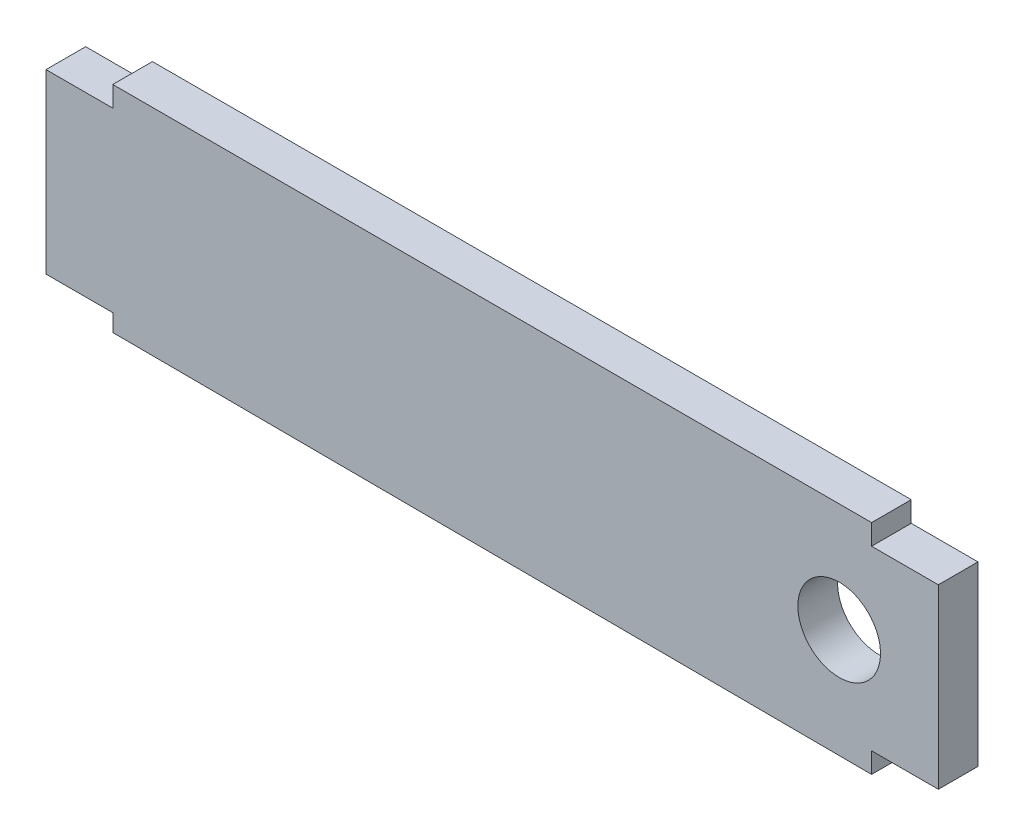
ISO-10303-21;
HEADER;
FILE_DESCRIPTION(('STEP AP214'),'2;1');
FILE_NAME('part.step','',(''),(''),'','','');
FILE_SCHEMA(('AUTOMOTIVE_DESIGN { 1 0 10303 214 1 1 1 1 }'));
ENDSEC;
DATA;
#1=APPLICATION_CONTEXT('core data for automotive mechanical design processes');
#2=APPLICATION_PROTOCOL_DEFINITION('international standard','automotive_design',2000,#1);
#3=PRODUCT_CONTEXT('',#1,'mechanical');
#4=PRODUCT('Part','Part','',(#3));
#5=PRODUCT_RELATED_PRODUCT_CATEGORY('part','',(#4));
#6=PRODUCT_DEFINITION_FORMATION('','',#4);
#7=PRODUCT_DEFINITION_CONTEXT('part definition',#1,'design');
#8=PRODUCT_DEFINITION('design','',#6,#7);
#9=PRODUCT_DEFINITION_SHAPE('','',#8);
#10=(LENGTH_UNIT() NAMED_UNIT(*) SI_UNIT(.MILLI.,.METRE.));
#11=(NAMED_UNIT(*) PLANE_ANGLE_UNIT() SI_UNIT($,.RADIAN.));
#12=(NAMED_UNIT(*) SI_UNIT($,.STERADIAN.) SOLID_ANGLE_UNIT());
#13=UNCERTAINTY_MEASURE_WITH_UNIT(LENGTH_MEASURE(1.E-05),#10,'distance_accuracy_value','');
#14=(GEOMETRIC_REPRESENTATION_CONTEXT(3) GLOBAL_UNCERTAINTY_ASSIGNED_CONTEXT((#13)) GLOBAL_UNIT_ASSIGNED_CONTEXT((#10,
#11,#12)) REPRESENTATION_CONTEXT('',''));
#15=CARTESIAN_POINT('',(0.,0.,0.));
#16=DIRECTION('',(0.,0.,1.));
#17=DIRECTION('',(1.,0.,0.));
#18=AXIS2_PLACEMENT_3D('',#15,#16,#17);
#19=CARTESIAN_POINT('',(57.4,-16.5,-38.));
#20=DIRECTION('',(1.,0.,0.));
#21=DIRECTION('',(0.,-1.,0.));
#22=AXIS2_PLACEMENT_3D('',#19,#20,#21);
#23=PLANE('',#22);
#24=DIRECTION('',(0.,0.,-1.));
#25=VECTOR('',#24,1.);
#26=CARTESIAN_POINT('',(57.4,-13.4000000000001,-38.));
#27=LINE('',#26,#25);
#28=CARTESIAN_POINT('',(57.4,-13.4000000000001,-32.));
#29=VERTEX_POINT('',#28);
#30=CARTESIAN_POINT('',(57.4,-13.4000000000001,-38.));
#31=VERTEX_POINT('',#30);
#32=EDGE_CURVE('E11',#29,#31,#27,.T.);
#33=ORIENTED_EDGE('',*,*,#32,.F.);
#34=DIRECTION('',(0.,1.,0.));
#35=VECTOR('',#34,1.);
#36=CARTESIAN_POINT('',(57.4,0.,-32.));
#37=LINE('',#36,#35);
#38=CARTESIAN_POINT('',(57.4,-16.5,-32.));
#39=VERTEX_POINT('',#38);
#40=EDGE_CURVE('E122',#29,#39,#37,.F.);
#41=ORIENTED_EDGE('',*,*,#40,.T.);
#42=DIRECTION('',(0.,0.,-1.));
#43=VECTOR('',#42,1.);
#44=CARTESIAN_POINT('',(57.4,-16.5,-38.));
#45=LINE('',#44,#43);
#46=CARTESIAN_POINT('',(57.4,-16.5,-38.));
#47=VERTEX_POINT('',#46);
#48=EDGE_CURVE('E50',#39,#47,#45,.T.);
#49=ORIENTED_EDGE('',*,*,#48,.T.);
#50=DIRECTION('',(0.,-1.,0.));
#51=VECTOR('',#50,1.);
#52=CARTESIAN_POINT('',(57.4,-16.5,-38.));
#53=LINE('',#52,#51);
#54=EDGE_CURVE('E214',#31,#47,#53,.T.);
#55=ORIENTED_EDGE('',*,*,#54,.F.);
#56=EDGE_LOOP('',(#33,#41,#49,#55));
#57=FACE_BOUND('',#56,.T.);
#58=ADVANCED_FACE('F39',(#57),#23,.T.);
#59=CARTESIAN_POINT('',(57.4,-16.5,-38.));
#60=DIRECTION('',(-0.0043553593875319,-0.999990515377324,0.));
#61=DIRECTION('',(-0.999990515377324,0.0043553593875319,0.));
#62=AXIS2_PLACEMENT_3D('',#59,#60,#61);
#63=PLANE('',#62);
#64=ORIENTED_EDGE('',*,*,#48,.F.);
#65=DIRECTION('',(-0.999990515377324,0.0043553593875319,0.));
#66=VECTOR('',#65,1.);
#67=CARTESIAN_POINT('',(57.4,-16.5,-32.));
#68=LINE('',#67,#66);
#69=CARTESIAN_POINT('',(-57.4,-16.,-32.));
#70=VERTEX_POINT('',#69);
#71=EDGE_CURVE('E164',#39,#70,#68,.T.);
#72=ORIENTED_EDGE('',*,*,#71,.T.);
#73=DIRECTION('',(0.,0.,-1.));
#74=VECTOR('',#73,1.);
#75=CARTESIAN_POINT('',(-57.4,-16.,-38.));
#76=LINE('',#75,#74);
#77=CARTESIAN_POINT('',(-57.4,-16.,-38.));
#78=VERTEX_POINT('',#77);
#79=EDGE_CURVE('E203',#70,#78,#76,.T.);
#80=ORIENTED_EDGE('',*,*,#79,.T.);
#81=DIRECTION('',(-0.999990515377324,0.0043553593875319,0.));
#82=VECTOR('',#81,1.);
#83=CARTESIAN_POINT('',(57.4,-16.5,-38.));
#84=LINE('',#83,#82);
#85=EDGE_CURVE('E224',#47,#78,#84,.T.);
#86=ORIENTED_EDGE('',*,*,#85,.F.);
#87=EDGE_LOOP('',(#64,#72,#80,#86));
#88=FACE_BOUND('',#87,.T.);
#89=ADVANCED_FACE('F227',(#88),#63,.T.);
#90=CARTESIAN_POINT('',(-57.4,-16.,-38.));
#91=DIRECTION('',(-1.,0.,0.));
#92=DIRECTION('',(0.,1.,0.));
#93=AXIS2_PLACEMENT_3D('',#90,#91,#92);
#94=PLANE('',#93);
#95=ORIENTED_EDGE('',*,*,#79,.F.);
#96=DIRECTION('',(0.,1.,0.));
#97=VECTOR('',#96,1.);
#98=CARTESIAN_POINT('',(-57.4,0.,-32.));
#99=LINE('',#98,#97);
#100=CARTESIAN_POINT('',(-57.4,-13.4,-32.));
#101=VERTEX_POINT('',#100);
#102=EDGE_CURVE('E160',#70,#101,#99,.T.);
#103=ORIENTED_EDGE('',*,*,#102,.T.);
#104=DIRECTION('',(0.,0.,-1.));
#105=VECTOR('',#104,1.);
#106=CARTESIAN_POINT('',(-57.4,-13.4,-38.));
#107=LINE('',#106,#105);
#108=CARTESIAN_POINT('',(-57.4,-13.4,-38.));
#109=VERTEX_POINT('',#108);
#110=EDGE_CURVE('E199',#101,#109,#107,.T.);
#111=ORIENTED_EDGE('',*,*,#110,.T.);
#112=DIRECTION('',(0.,1.,0.));
#113=VECTOR('',#112,1.);
#114=CARTESIAN_POINT('',(-57.4,-16.,-38.));
#115=LINE('',#114,#113);
#116=EDGE_CURVE('E229',#78,#109,#115,.T.);
#117=ORIENTED_EDGE('',*,*,#116,.F.);
#118=EDGE_LOOP('',(#95,#103,#111,#117));
#119=FACE_BOUND('',#118,.T.);
#120=ADVANCED_FACE('F282',(#119),#94,.T.);
#121=CARTESIAN_POINT('',(-57.4,-13.4,-38.));
#122=DIRECTION('',(0.,-1.,0.));
#123=DIRECTION('',(-1.,0.,0.));
#124=AXIS2_PLACEMENT_3D('',#121,#122,#123);
#125=PLANE('',#124);
#126=ORIENTED_EDGE('',*,*,#110,.F.);
#127=DIRECTION('',(-1.,0.,0.));
#128=VECTOR('',#127,1.);
#129=CARTESIAN_POINT('',(0.,-13.4,-32.));
#130=LINE('',#129,#128);
#131=CARTESIAN_POINT('',(-67.5,-13.4,-32.));
#132=VERTEX_POINT('',#131);
#133=EDGE_CURVE('E156',#101,#132,#130,.T.);
#134=ORIENTED_EDGE('',*,*,#133,.T.);
#135=DIRECTION('',(0.,0.,-1.));
#136=VECTOR('',#135,1.);
#137=CARTESIAN_POINT('',(-67.5,-13.4,-38.));
#138=LINE('',#137,#136);
#139=CARTESIAN_POINT('',(-67.5,-13.4,-38.));
#140=VERTEX_POINT('',#139);
#141=EDGE_CURVE('E195',#132,#140,#138,.T.);
#142=ORIENTED_EDGE('',*,*,#141,.T.);
#143=DIRECTION('',(-1.,0.,0.));
#144=VECTOR('',#143,1.);
#145=CARTESIAN_POINT('',(-57.4,-13.4,-38.));
#146=LINE('',#145,#144);
#147=EDGE_CURVE('E233',#109,#140,#146,.T.);
#148=ORIENTED_EDGE('',*,*,#147,.F.);
#149=EDGE_LOOP('',(#126,#134,#142,#148));
#150=FACE_BOUND('',#149,.T.);
#151=ADVANCED_FACE('F315',(#150),#125,.T.);
#152=CARTESIAN_POINT('',(-67.5,-13.4,-38.));
#153=DIRECTION('',(-1.,0.,0.));
#154=DIRECTION('',(0.,1.,0.));
#155=AXIS2_PLACEMENT_3D('',#152,#153,#154);
#156=PLANE('',#155);
#157=ORIENTED_EDGE('',*,*,#141,.F.);
#158=DIRECTION('',(0.,1.,0.));
#159=VECTOR('',#158,1.);
#160=CARTESIAN_POINT('',(-67.5,0.,-32.));
#161=LINE('',#160,#159);
#162=CARTESIAN_POINT('',(-67.5,13.4,-32.));
#163=VERTEX_POINT('',#162);
#164=EDGE_CURVE('E152',#132,#163,#161,.T.);
#165=ORIENTED_EDGE('',*,*,#164,.T.);
#166=DIRECTION('',(0.,0.,-1.));
#167=VECTOR('',#166,1.);
#168=CARTESIAN_POINT('',(-67.5,13.4,-38.));
#169=LINE('',#168,#167);
#170=CARTESIAN_POINT('',(-67.5,13.4,-38.));
#171=VERTEX_POINT('',#170);
#172=EDGE_CURVE('E191',#163,#171,#169,.T.);
#173=ORIENTED_EDGE('',*,*,#172,.T.);
#174=DIRECTION('',(0.,1.,0.));
#175=VECTOR('',#174,1.);
#176=CARTESIAN_POINT('',(-67.5,-13.4,-38.));
#177=LINE('',#176,#175);
#178=EDGE_CURVE('E240',#140,#171,#177,.T.);
#179=ORIENTED_EDGE('',*,*,#178,.F.);
#180=EDGE_LOOP('',(#157,#165,#173,#179));
#181=FACE_BOUND('',#180,.T.);
#182=ADVANCED_FACE('F311',(#181),#156,.T.);
#183=CARTESIAN_POINT('',(-67.5,13.4,-38.));
#184=DIRECTION('',(0.,1.,0.));
#185=DIRECTION('',(1.,0.,0.));
#186=AXIS2_PLACEMENT_3D('',#183,#184,#185);
#187=PLANE('',#186);
#188=ORIENTED_EDGE('',*,*,#172,.F.);
#189=DIRECTION('',(-1.,0.,0.));
#190=VECTOR('',#189,1.);
#191=CARTESIAN_POINT('',(0.,13.4,-32.));
#192=LINE('',#191,#190);
#193=CARTESIAN_POINT('',(-57.4,13.4,-32.));
#194=VERTEX_POINT('',#193);
#195=EDGE_CURVE('E148',#163,#194,#192,.F.);
#196=ORIENTED_EDGE('',*,*,#195,.T.);
#197=DIRECTION('',(0.,0.,-1.));
#198=VECTOR('',#197,1.);
#199=CARTESIAN_POINT('',(-57.4,13.4,-38.));
#200=LINE('',#199,#198);
#201=CARTESIAN_POINT('',(-57.4,13.4,-38.));
#202=VERTEX_POINT('',#201);
#203=EDGE_CURVE('E187',#194,#202,#200,.T.);
#204=ORIENTED_EDGE('',*,*,#203,.T.);
#205=DIRECTION('',(1.,0.,0.));
#206=VECTOR('',#205,1.);
#207=CARTESIAN_POINT('',(-67.5,13.4,-38.));
#208=LINE('',#207,#206);
#209=EDGE_CURVE('E244',#171,#202,#208,.T.);
#210=ORIENTED_EDGE('',*,*,#209,.F.);
#211=EDGE_LOOP('',(#188,#196,#204,#210));
#212=FACE_BOUND('',#211,.T.);
#213=ADVANCED_FACE('F307',(#212),#187,.T.);
#214=CARTESIAN_POINT('',(-57.4,13.4,-38.));
#215=DIRECTION('',(-1.,0.,0.));
#216=DIRECTION('',(0.,1.,0.));
#217=AXIS2_PLACEMENT_3D('',#214,#215,#216);
#218=PLANE('',#217);
#219=ORIENTED_EDGE('',*,*,#203,.F.);
#220=DIRECTION('',(0.,1.,0.));
#221=VECTOR('',#220,1.);
#222=CARTESIAN_POINT('',(-57.4,0.,-32.));
#223=LINE('',#222,#221);
#224=CARTESIAN_POINT('',(-57.4,16.5,-32.));
#225=VERTEX_POINT('',#224);
#226=EDGE_CURVE('E144',#194,#225,#223,.T.);
#227=ORIENTED_EDGE('',*,*,#226,.T.);
#228=DIRECTION('',(0.,0.,-1.));
#229=VECTOR('',#228,1.);
#230=CARTESIAN_POINT('',(-57.4,16.5,-38.));
#231=LINE('',#230,#229);
#232=CARTESIAN_POINT('',(-57.4,16.5,-38.));
#233=VERTEX_POINT('',#232);
#234=EDGE_CURVE('E183',#225,#233,#231,.T.);
#235=ORIENTED_EDGE('',*,*,#234,.T.);
#236=DIRECTION('',(0.,1.,0.));
#237=VECTOR('',#236,1.);
#238=CARTESIAN_POINT('',(-57.4,13.4,-38.));
#239=LINE('',#238,#237);
#240=EDGE_CURVE('E248',#202,#233,#239,.T.);
#241=ORIENTED_EDGE('',*,*,#240,.F.);
#242=EDGE_LOOP('',(#219,#227,#235,#241));
#243=FACE_BOUND('',#242,.T.);
#244=ADVANCED_FACE('F303',(#243),#218,.T.);
#245=CARTESIAN_POINT('',(57.4,16.5,-38.));
#246=DIRECTION('',(0.,1.,0.));
#247=DIRECTION('',(1.,0.,0.));
#248=AXIS2_PLACEMENT_3D('',#245,#246,#247);
#249=PLANE('',#248);
#250=ORIENTED_EDGE('',*,*,#234,.F.);
#251=DIRECTION('',(-1.,0.,0.));
#252=VECTOR('',#251,1.);
#253=CARTESIAN_POINT('',(0.,16.5,-32.));
#254=LINE('',#253,#252);
#255=CARTESIAN_POINT('',(57.4,16.5,-32.));
#256=VERTEX_POINT('',#255);
#257=EDGE_CURVE('E140',#225,#256,#254,.F.);
#258=ORIENTED_EDGE('',*,*,#257,.T.);
#259=DIRECTION('',(0.,0.,-1.));
#260=VECTOR('',#259,1.);
#261=CARTESIAN_POINT('',(57.4,16.5,-38.));
#262=LINE('',#261,#260);
#263=CARTESIAN_POINT('',(57.4,16.5,-38.));
#264=VERTEX_POINT('',#263);
#265=EDGE_CURVE('E179',#256,#264,#262,.T.);
#266=ORIENTED_EDGE('',*,*,#265,.T.);
#267=DIRECTION('',(1.,0.,0.));
#268=VECTOR('',#267,1.);
#269=CARTESIAN_POINT('',(57.4,16.5,-38.));
#270=LINE('',#269,#268);
#271=EDGE_CURVE('E252',#233,#264,#270,.T.);
#272=ORIENTED_EDGE('',*,*,#271,.F.);
#273=EDGE_LOOP('',(#250,#258,#266,#272));
#274=FACE_BOUND('',#273,.T.);
#275=ADVANCED_FACE('F299',(#274),#249,.T.);
#276=CARTESIAN_POINT('',(57.4,16.5,-38.));
#277=DIRECTION('',(1.,0.,0.));
#278=DIRECTION('',(0.,-1.,0.));
#279=AXIS2_PLACEMENT_3D('',#276,#277,#278);
#280=PLANE('',#279);
#281=ORIENTED_EDGE('',*,*,#265,.F.);
#282=DIRECTION('',(0.,1.,0.));
#283=VECTOR('',#282,1.);
#284=CARTESIAN_POINT('',(57.4,0.,-32.));
#285=LINE('',#284,#283);
#286=CARTESIAN_POINT('',(57.4,13.4,-32.));
#287=VERTEX_POINT('',#286);
#288=EDGE_CURVE('E136',#256,#287,#285,.F.);
#289=ORIENTED_EDGE('',*,*,#288,.T.);
#290=DIRECTION('',(0.,0.,-1.));
#291=VECTOR('',#290,1.);
#292=CARTESIAN_POINT('',(57.4,13.4,-38.));
#293=LINE('',#292,#291);
#294=CARTESIAN_POINT('',(57.4,13.4,-38.));
#295=VERTEX_POINT('',#294);
#296=EDGE_CURVE('E176',#287,#295,#293,.T.);
#297=ORIENTED_EDGE('',*,*,#296,.T.);
#298=DIRECTION('',(0.,-1.,0.));
#299=VECTOR('',#298,1.);
#300=CARTESIAN_POINT('',(57.4,16.5,-38.));
#301=LINE('',#300,#299);
#302=EDGE_CURVE('E256',#264,#295,#301,.T.);
#303=ORIENTED_EDGE('',*,*,#302,.F.);
#304=EDGE_LOOP('',(#281,#289,#297,#303));
#305=FACE_BOUND('',#304,.T.);
#306=ADVANCED_FACE('F294',(#305),#280,.T.);
#307=CARTESIAN_POINT('',(57.4,13.4,-38.));
#308=DIRECTION('',(0.,1.,0.));
#309=DIRECTION('',(1.,0.,0.));
#310=AXIS2_PLACEMENT_3D('',#307,#308,#309);
#311=PLANE('',#310);
#312=ORIENTED_EDGE('',*,*,#296,.F.);
#313=DIRECTION('',(-1.,0.,0.));
#314=VECTOR('',#313,1.);
#315=CARTESIAN_POINT('',(0.,13.4,-32.));
#316=LINE('',#315,#314);
#317=CARTESIAN_POINT('',(67.5,13.4,-32.));
#318=VERTEX_POINT('',#317);
#319=EDGE_CURVE('E133',#287,#318,#316,.F.);
#320=ORIENTED_EDGE('',*,*,#319,.T.);
#321=DIRECTION('',(0.,0.,-1.));
#322=VECTOR('',#321,1.);
#323=CARTESIAN_POINT('',(67.5,13.4,-38.));
#324=LINE('',#323,#322);
#325=CARTESIAN_POINT('',(67.5,13.4,-38.));
#326=VERTEX_POINT('',#325);
#327=EDGE_CURVE('E58',#318,#326,#324,.T.);
#328=ORIENTED_EDGE('',*,*,#327,.T.);
#329=DIRECTION('',(1.,0.,0.));
#330=VECTOR('',#329,1.);
#331=CARTESIAN_POINT('',(57.4,13.4,-38.));
#332=LINE('',#331,#330);
#333=EDGE_CURVE('E259',#295,#326,#332,.T.);
#334=ORIENTED_EDGE('',*,*,#333,.F.);
#335=EDGE_LOOP('',(#312,#320,#328,#334));
#336=FACE_BOUND('',#335,.T.);
#337=ADVANCED_FACE('F289',(#336),#311,.T.);
#338=CARTESIAN_POINT('',(67.5,13.4,-38.));
#339=DIRECTION('',(1.,0.,0.));
#340=DIRECTION('',(0.,-1.,0.));
#341=AXIS2_PLACEMENT_3D('',#338,#339,#340);
#342=PLANE('',#341);
#343=ORIENTED_EDGE('',*,*,#327,.F.);
#344=DIRECTION('',(0.,1.,0.));
#345=VECTOR('',#344,1.);
#346=CARTESIAN_POINT('',(67.5,0.,-32.));
#347=LINE('',#346,#345);
#348=CARTESIAN_POINT('',(67.5,-13.4000000000001,-32.));
#349=VERTEX_POINT('',#348);
#350=EDGE_CURVE('E120',#318,#349,#347,.F.);
#351=ORIENTED_EDGE('',*,*,#350,.T.);
#352=DIRECTION('',(0.,0.,-1.));
#353=VECTOR('',#352,1.);
#354=CARTESIAN_POINT('',(67.5,-13.4000000000001,-38.));
#355=LINE('',#354,#353);
#356=CARTESIAN_POINT('',(67.5,-13.4000000000001,-38.));
#357=VERTEX_POINT('',#356);
#358=EDGE_CURVE('E43',#349,#357,#355,.T.);
#359=ORIENTED_EDGE('',*,*,#358,.T.);
#360=DIRECTION('',(0.,-1.,0.));
#361=VECTOR('',#360,1.);
#362=CARTESIAN_POINT('',(67.5,13.4,-38.));
#363=LINE('',#362,#361);
#364=EDGE_CURVE('E173',#326,#357,#363,.T.);
#365=ORIENTED_EDGE('',*,*,#364,.F.);
#366=EDGE_LOOP('',(#343,#351,#359,#365));
#367=FACE_BOUND('',#366,.T.);
#368=ADVANCED_FACE('F125',(#367),#342,.T.);
#369=CARTESIAN_POINT('',(67.5,-13.4000000000001,-38.));
#370=DIRECTION('',(0.,-1.,0.));
#371=DIRECTION('',(-1.,0.,0.));
#372=AXIS2_PLACEMENT_3D('',#369,#370,#371);
#373=PLANE('',#372);
#374=DIRECTION('',(-1.,0.,0.));
#375=VECTOR('',#374,1.);
#376=CARTESIAN_POINT('',(0.,-13.4000000000001,-32.));
#377=LINE('',#376,#375);
#378=EDGE_CURVE('E107',#349,#29,#377,.T.);
#379=ORIENTED_EDGE('',*,*,#378,.T.);
#380=ORIENTED_EDGE('',*,*,#32,.T.);
#381=DIRECTION('',(-1.,0.,0.));
#382=VECTOR('',#381,1.);
#383=CARTESIAN_POINT('',(67.5,-13.4000000000001,-38.));
#384=LINE('',#383,#382);
#385=EDGE_CURVE('E109',#357,#31,#384,.T.);
#386=ORIENTED_EDGE('',*,*,#385,.F.);
#387=ORIENTED_EDGE('',*,*,#358,.F.);
#388=EDGE_LOOP('',(#379,#380,#386,#387));
#389=FACE_BOUND('',#388,.T.);
#390=ADVANCED_FACE('F106',(#389),#373,.T.);
#391=CARTESIAN_POINT('',(52.5,0.,-38.));
#392=DIRECTION('',(0.,0.,-1.));
#393=DIRECTION('',(-1.,0.,0.));
#394=AXIS2_PLACEMENT_3D('',#391,#392,#393);
#395=CYLINDRICAL_SURFACE('',#394,6.25);
#396=CARTESIAN_POINT('',(52.5,0.,-38.));
#397=DIRECTION('',(0.,0.,-1.));
#398=DIRECTION('',(-1.,0.,0.));
#399=AXIS2_PLACEMENT_3D('',#396,#397,#398);
#400=CIRCLE('',#399,6.25);
#401=CARTESIAN_POINT('',(46.25,0.,-38.));
#402=VERTEX_POINT('',#401);
#403=EDGE_CURVE('E114',#402,#402,#400,.T.);
#404=ORIENTED_EDGE('',*,*,#403,.T.);
#405=EDGE_LOOP('',(#404));
#406=FACE_BOUND('',#405,.T.);
#407=CARTESIAN_POINT('',(52.5,0.,-32.));
#408=DIRECTION('',(0.,0.,-1.));
#409=DIRECTION('',(-1.,0.,0.));
#410=AXIS2_PLACEMENT_3D('',#407,#408,#409);
#411=CIRCLE('',#410,6.25);
#412=CARTESIAN_POINT('',(46.25,0.,-32.));
#413=VERTEX_POINT('',#412);
#414=EDGE_CURVE('E135',#413,#413,#411,.T.);
#415=ORIENTED_EDGE('',*,*,#414,.F.);
#416=EDGE_LOOP('',(#415));
#417=FACE_BOUND('',#416,.T.);
#418=ADVANCED_FACE('F41',(#406,#417),#395,.F.);
#419=CARTESIAN_POINT('',(0.,0.,-38.));
#420=DIRECTION('',(0.,0.,-1.));
#421=DIRECTION('',(-1.,0.,0.));
#422=AXIS2_PLACEMENT_3D('',#419,#420,#421);
#423=PLANE('',#422);
#424=ORIENTED_EDGE('',*,*,#364,.T.);
#425=ORIENTED_EDGE('',*,*,#385,.T.);
#426=ORIENTED_EDGE('',*,*,#54,.T.);
#427=ORIENTED_EDGE('',*,*,#85,.T.);
#428=ORIENTED_EDGE('',*,*,#116,.T.);
#429=ORIENTED_EDGE('',*,*,#147,.T.);
#430=ORIENTED_EDGE('',*,*,#178,.T.);
#431=ORIENTED_EDGE('',*,*,#209,.T.);
#432=ORIENTED_EDGE('',*,*,#240,.T.);
#433=ORIENTED_EDGE('',*,*,#271,.T.);
#434=ORIENTED_EDGE('',*,*,#302,.T.);
#435=ORIENTED_EDGE('',*,*,#333,.T.);
#436=EDGE_LOOP('',(#424,#425,#426,#427,#428,#429,#430,#431,#432,#433,#434,#435));
#437=FACE_BOUND('',#436,.T.);
#438=ORIENTED_EDGE('',*,*,#403,.F.);
#439=EDGE_LOOP('',(#438));
#440=FACE_BOUND('',#439,.T.);
#441=ADVANCED_FACE('F221',(#437,#440),#423,.T.);
#442=CARTESIAN_POINT('',(0.,0.,-32.));
#443=DIRECTION('',(0.,0.,-1.));
#444=DIRECTION('',(-1.,0.,0.));
#445=AXIS2_PLACEMENT_3D('',#442,#443,#444);
#446=PLANE('',#445);
#447=ORIENTED_EDGE('',*,*,#350,.F.);
#448=ORIENTED_EDGE('',*,*,#319,.F.);
#449=ORIENTED_EDGE('',*,*,#288,.F.);
#450=ORIENTED_EDGE('',*,*,#257,.F.);
#451=ORIENTED_EDGE('',*,*,#226,.F.);
#452=ORIENTED_EDGE('',*,*,#195,.F.);
#453=ORIENTED_EDGE('',*,*,#164,.F.);
#454=ORIENTED_EDGE('',*,*,#133,.F.);
#455=ORIENTED_EDGE('',*,*,#102,.F.);
#456=ORIENTED_EDGE('',*,*,#71,.F.);
#457=ORIENTED_EDGE('',*,*,#40,.F.);
#458=ORIENTED_EDGE('',*,*,#378,.F.);
#459=EDGE_LOOP('',(#447,#448,#449,#450,#451,#452,#453,#454,#455,#456,#457,#458));
#460=FACE_BOUND('',#459,.T.);
#461=ORIENTED_EDGE('',*,*,#414,.T.);
#462=EDGE_LOOP('',(#461));
#463=FACE_BOUND('',#462,.T.);
#464=ADVANCED_FACE('F117',(#460,#463),#446,.F.);
#465=CLOSED_SHELL('',(#58,#89,#120,#151,#182,#213,#244,#275,#306,#337,#368,#390,#418,#441,#464));
#466=MANIFOLD_SOLID_BREP('B2',#465);
#467=ADVANCED_BREP_SHAPE_REPRESENTATION('',(#18,#466),#14);
#468=SHAPE_DEFINITION_REPRESENTATION(#9,#467);
ENDSEC;
END-ISO-10303-21;
